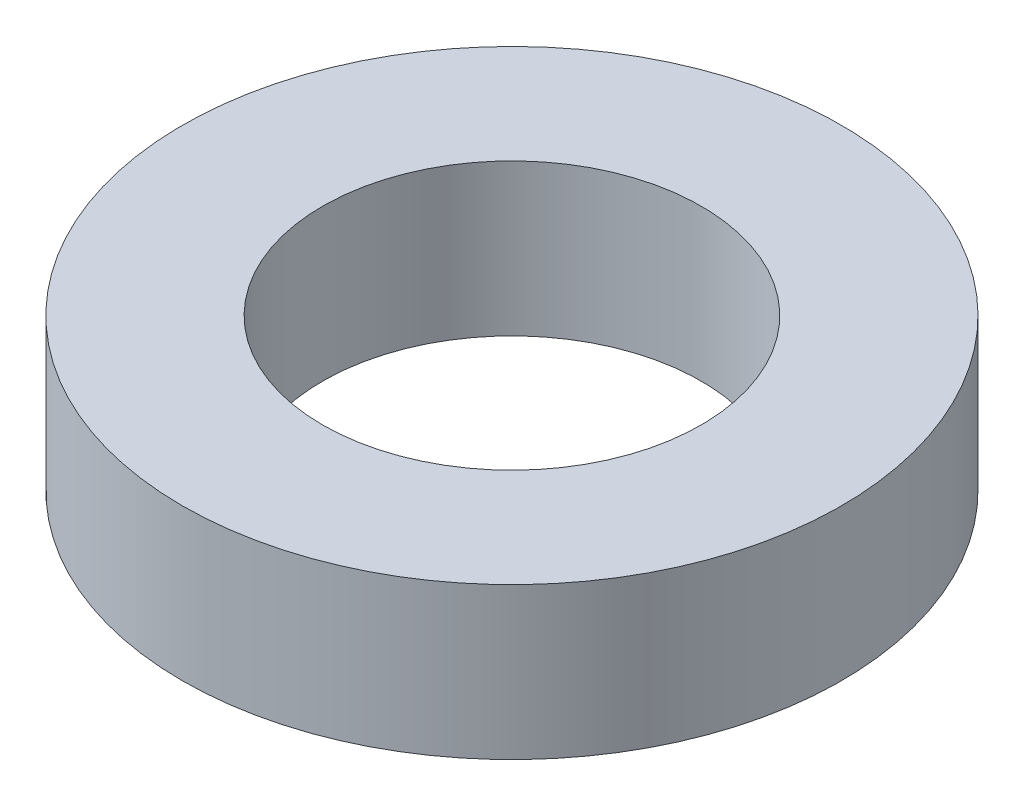
ISO-10303-21;
HEADER;
FILE_DESCRIPTION(('STEP AP214'),'2;1');
FILE_NAME('part.step','',(''),(''),'','','');
FILE_SCHEMA(('AUTOMOTIVE_DESIGN { 1 0 10303 214 1 1 1 1 }'));
ENDSEC;
DATA;
#1=APPLICATION_CONTEXT('core data for automotive mechanical design processes');
#2=APPLICATION_PROTOCOL_DEFINITION('international standard','automotive_design',2000,#1);
#3=PRODUCT_CONTEXT('',#1,'mechanical');
#4=PRODUCT('Part','Part','',(#3));
#5=PRODUCT_RELATED_PRODUCT_CATEGORY('part','',(#4));
#6=PRODUCT_DEFINITION_FORMATION('','',#4);
#7=PRODUCT_DEFINITION_CONTEXT('part definition',#1,'design');
#8=PRODUCT_DEFINITION('design','',#6,#7);
#9=PRODUCT_DEFINITION_SHAPE('','',#8);
#10=(LENGTH_UNIT() NAMED_UNIT(*) SI_UNIT(.MILLI.,.METRE.));
#11=(NAMED_UNIT(*) PLANE_ANGLE_UNIT() SI_UNIT($,.RADIAN.));
#12=(NAMED_UNIT(*) SI_UNIT($,.STERADIAN.) SOLID_ANGLE_UNIT());
#13=UNCERTAINTY_MEASURE_WITH_UNIT(LENGTH_MEASURE(1.E-05),#10,'distance_accuracy_value','');
#14=(GEOMETRIC_REPRESENTATION_CONTEXT(3) GLOBAL_UNCERTAINTY_ASSIGNED_CONTEXT((#13)) GLOBAL_UNIT_ASSIGNED_CONTEXT((#10,
#11,#12)) REPRESENTATION_CONTEXT('',''));
#15=CARTESIAN_POINT('',(0.,0.,0.));
#16=DIRECTION('',(0.,0.,1.));
#17=DIRECTION('',(1.,0.,0.));
#18=AXIS2_PLACEMENT_3D('',#15,#16,#17);
#19=CARTESIAN_POINT('',(0.,5.08,0.));
#20=DIRECTION('',(0.,1.,0.));
#21=DIRECTION('',(0.,0.,1.));
#22=AXIS2_PLACEMENT_3D('',#19,#20,#21);
#23=PLANE('',#22);
#24=CARTESIAN_POINT('',(0.,5.08,0.));
#25=DIRECTION('',(0.,1.,0.));
#26=DIRECTION('',(0.,0.,1.));
#27=AXIS2_PLACEMENT_3D('',#24,#25,#26);
#28=CIRCLE('',#27,11.049);
#29=CARTESIAN_POINT('',(0.,5.08,11.049));
#30=VERTEX_POINT('',#29);
#31=EDGE_CURVE('E10',#30,#30,#28,.T.);
#32=ORIENTED_EDGE('',*,*,#31,.T.);
#33=EDGE_LOOP('',(#32));
#34=FACE_BOUND('',#33,.T.);
#35=CARTESIAN_POINT('',(0.,5.08,0.));
#36=DIRECTION('',(0.,1.,0.));
#37=DIRECTION('',(0.,0.,1.));
#38=AXIS2_PLACEMENT_3D('',#35,#36,#37);
#39=CIRCLE('',#38,6.35);
#40=CARTESIAN_POINT('',(0.,5.08,6.35));
#41=VERTEX_POINT('',#40);
#42=EDGE_CURVE('E43',#41,#41,#39,.T.);
#43=ORIENTED_EDGE('',*,*,#42,.F.);
#44=EDGE_LOOP('',(#43));
#45=FACE_BOUND('',#44,.T.);
#46=ADVANCED_FACE('F32',(#34,#45),#23,.T.);
#47=CARTESIAN_POINT('',(0.,0.,0.));
#48=DIRECTION('',(0.,1.,0.));
#49=DIRECTION('',(0.,0.,1.));
#50=AXIS2_PLACEMENT_3D('',#47,#48,#49);
#51=PLANE('',#50);
#52=CARTESIAN_POINT('',(0.,0.,0.));
#53=DIRECTION('',(0.,1.,0.));
#54=DIRECTION('',(0.,0.,1.));
#55=AXIS2_PLACEMENT_3D('',#52,#53,#54);
#56=CIRCLE('',#55,11.049);
#57=CARTESIAN_POINT('',(0.,0.,11.049));
#58=VERTEX_POINT('',#57);
#59=EDGE_CURVE('E36',#58,#58,#56,.T.);
#60=ORIENTED_EDGE('',*,*,#59,.F.);
#61=EDGE_LOOP('',(#60));
#62=FACE_BOUND('',#61,.T.);
#63=CARTESIAN_POINT('',(0.,0.,0.));
#64=DIRECTION('',(0.,1.,0.));
#65=DIRECTION('',(0.,0.,1.));
#66=AXIS2_PLACEMENT_3D('',#63,#64,#65);
#67=CIRCLE('',#66,6.35);
#68=CARTESIAN_POINT('',(0.,0.,6.35));
#69=VERTEX_POINT('',#68);
#70=EDGE_CURVE('E45',#69,#69,#67,.T.);
#71=ORIENTED_EDGE('',*,*,#70,.T.);
#72=EDGE_LOOP('',(#71));
#73=FACE_BOUND('',#72,.T.);
#74=ADVANCED_FACE('F55',(#62,#73),#51,.F.);
#75=CARTESIAN_POINT('',(0.,5.08,0.));
#76=DIRECTION('',(0.,-1.,0.));
#77=DIRECTION('',(0.,0.,-1.));
#78=AXIS2_PLACEMENT_3D('',#75,#76,#77);
#79=CYLINDRICAL_SURFACE('',#78,11.049);
#80=ORIENTED_EDGE('',*,*,#31,.F.);
#81=EDGE_LOOP('',(#80));
#82=FACE_BOUND('',#81,.T.);
#83=ORIENTED_EDGE('',*,*,#59,.T.);
#84=EDGE_LOOP('',(#83));
#85=FACE_BOUND('',#84,.T.);
#86=ADVANCED_FACE('F34',(#82,#85),#79,.T.);
#87=CARTESIAN_POINT('',(0.,5.08,0.));
#88=DIRECTION('',(0.,-1.,0.));
#89=DIRECTION('',(0.,0.,-1.));
#90=AXIS2_PLACEMENT_3D('',#87,#88,#89);
#91=CYLINDRICAL_SURFACE('',#90,6.35);
#92=ORIENTED_EDGE('',*,*,#42,.T.);
#93=EDGE_LOOP('',(#92));
#94=FACE_BOUND('',#93,.T.);
#95=ORIENTED_EDGE('',*,*,#70,.F.);
#96=EDGE_LOOP('',(#95));
#97=FACE_BOUND('',#96,.T.);
#98=ADVANCED_FACE('F51',(#94,#97),#91,.F.);
#99=CLOSED_SHELL('',(#46,#74,#86,#98));
#100=MANIFOLD_SOLID_BREP('B2',#99);
#101=ADVANCED_BREP_SHAPE_REPRESENTATION('',(#18,#100),#14);
#102=SHAPE_DEFINITION_REPRESENTATION(#9,#101);
ENDSEC;
END-ISO-10303-21;
